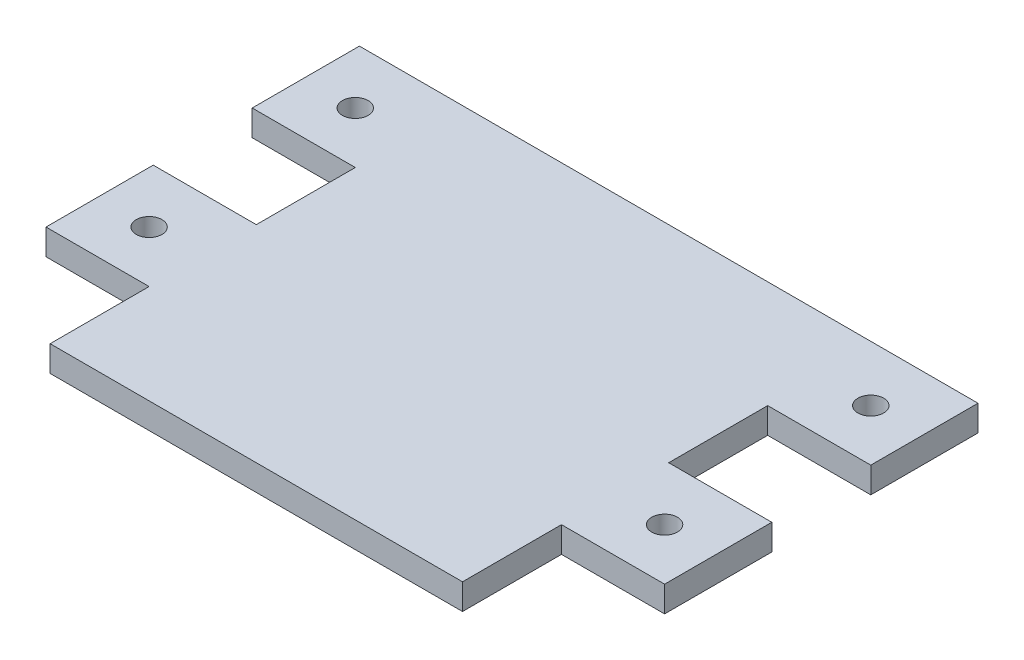
ISO-10303-21;
HEADER;
FILE_DESCRIPTION(('STEP AP214'),'2;1');
FILE_NAME('part.step','',(''),(''),'','','');
FILE_SCHEMA(('AUTOMOTIVE_DESIGN { 1 0 10303 214 1 1 1 1 }'));
ENDSEC;
DATA;
#1=APPLICATION_CONTEXT('core data for automotive mechanical design processes');
#2=APPLICATION_PROTOCOL_DEFINITION('international standard','automotive_design',2000,#1);
#3=PRODUCT_CONTEXT('',#1,'mechanical');
#4=PRODUCT('Part','Part','',(#3));
#5=PRODUCT_RELATED_PRODUCT_CATEGORY('part','',(#4));
#6=PRODUCT_DEFINITION_FORMATION('','',#4);
#7=PRODUCT_DEFINITION_CONTEXT('part definition',#1,'design');
#8=PRODUCT_DEFINITION('design','',#6,#7);
#9=PRODUCT_DEFINITION_SHAPE('','',#8);
#10=(LENGTH_UNIT() NAMED_UNIT(*) SI_UNIT(.MILLI.,.METRE.));
#11=(NAMED_UNIT(*) PLANE_ANGLE_UNIT() SI_UNIT($,.RADIAN.));
#12=(NAMED_UNIT(*) SI_UNIT($,.STERADIAN.) SOLID_ANGLE_UNIT());
#13=UNCERTAINTY_MEASURE_WITH_UNIT(LENGTH_MEASURE(1.E-05),#10,'distance_accuracy_value','');
#14=(GEOMETRIC_REPRESENTATION_CONTEXT(3) GLOBAL_UNCERTAINTY_ASSIGNED_CONTEXT((#13)) GLOBAL_UNIT_ASSIGNED_CONTEXT((#10,
#11,#12)) REPRESENTATION_CONTEXT('',''));
#15=CARTESIAN_POINT('',(0.,0.,0.));
#16=DIRECTION('',(0.,0.,1.));
#17=DIRECTION('',(1.,0.,0.));
#18=AXIS2_PLACEMENT_3D('',#15,#16,#17);
#19=CARTESIAN_POINT('',(0.,3.175,0.));
#20=DIRECTION('',(1.,0.,0.));
#21=DIRECTION('',(0.,0.,-1.));
#22=AXIS2_PLACEMENT_3D('',#19,#20,#21);
#23=PLANE('',#22);
#24=DIRECTION('',(0.,1.,0.));
#25=VECTOR('',#24,1.);
#26=CARTESIAN_POINT('',(0.,0.,-12.192));
#27=LINE('',#26,#25);
#28=CARTESIAN_POINT('',(0.,0.,-12.192));
#29=VERTEX_POINT('',#28);
#30=CARTESIAN_POINT('',(0.,3.175,-12.192));
#31=VERTEX_POINT('',#30);
#32=EDGE_CURVE('E182',#29,#31,#27,.T.);
#33=ORIENTED_EDGE('',*,*,#32,.F.);
#34=DIRECTION('',(0.,0.,1.));
#35=VECTOR('',#34,1.);
#36=CARTESIAN_POINT('',(0.,0.,0.));
#37=LINE('',#36,#35);
#38=CARTESIAN_POINT('',(0.,0.,0.));
#39=VERTEX_POINT('',#38);
#40=EDGE_CURVE('E267',#29,#39,#37,.T.);
#41=ORIENTED_EDGE('',*,*,#40,.T.);
#42=DIRECTION('',(0.,-1.,0.));
#43=VECTOR('',#42,1.);
#44=CARTESIAN_POINT('',(0.,3.175,0.));
#45=LINE('',#44,#43);
#46=CARTESIAN_POINT('',(0.,3.175,0.));
#47=VERTEX_POINT('',#46);
#48=EDGE_CURVE('E11',#47,#39,#45,.T.);
#49=ORIENTED_EDGE('',*,*,#48,.F.);
#50=DIRECTION('',(0.,0.,1.));
#51=VECTOR('',#50,1.);
#52=CARTESIAN_POINT('',(0.,3.175,0.));
#53=LINE('',#52,#51);
#54=EDGE_CURVE('E47',#31,#47,#53,.T.);
#55=ORIENTED_EDGE('',*,*,#54,.F.);
#56=EDGE_LOOP('',(#33,#41,#49,#55));
#57=FACE_BOUND('',#56,.T.);
#58=ADVANCED_FACE('F33',(#57),#23,.F.);
#59=DIRECTION('',(0.,1.,0.));
#60=VECTOR('',#59,1.);
#61=CARTESIAN_POINT('',(0.,0.,-25.4));
#62=LINE('',#61,#60);
#63=CARTESIAN_POINT('',(0.,0.,-25.4));
#64=VERTEX_POINT('',#63);
#65=CARTESIAN_POINT('',(0.,3.175,-25.4));
#66=VERTEX_POINT('',#65);
#67=EDGE_CURVE('E55',#64,#66,#62,.T.);
#68=ORIENTED_EDGE('',*,*,#67,.T.);
#69=CARTESIAN_POINT('',(0.,3.175,-37.592));
#70=VERTEX_POINT('',#69);
#71=EDGE_CURVE('E272',#70,#66,#53,.T.);
#72=ORIENTED_EDGE('',*,*,#71,.F.);
#73=DIRECTION('',(0.,1.,0.));
#74=VECTOR('',#73,1.);
#75=CARTESIAN_POINT('',(0.,0.,-37.592));
#76=LINE('',#75,#74);
#77=CARTESIAN_POINT('',(0.,0.,-37.592));
#78=VERTEX_POINT('',#77);
#79=EDGE_CURVE('E204',#78,#70,#76,.T.);
#80=ORIENTED_EDGE('',*,*,#79,.F.);
#81=EDGE_CURVE('E282',#78,#64,#37,.T.);
#82=ORIENTED_EDGE('',*,*,#81,.T.);
#83=EDGE_LOOP('',(#68,#72,#80,#82));
#84=FACE_BOUND('',#83,.T.);
#85=ADVANCED_FACE('F315',(#84),#23,.F.);
#86=CARTESIAN_POINT('',(50.8,3.175,0.));
#87=DIRECTION('',(-1.,0.,0.));
#88=DIRECTION('',(0.,0.,1.));
#89=AXIS2_PLACEMENT_3D('',#86,#87,#88);
#90=PLANE('',#89);
#91=DIRECTION('',(0.,0.,-1.));
#92=VECTOR('',#91,1.);
#93=CARTESIAN_POINT('',(50.8,3.175,0.));
#94=LINE('',#93,#92);
#95=CARTESIAN_POINT('',(50.8,3.175,-25.4));
#96=VERTEX_POINT('',#95);
#97=CARTESIAN_POINT('',(50.8,3.175,-37.592));
#98=VERTEX_POINT('',#97);
#99=EDGE_CURVE('E276',#96,#98,#94,.T.);
#100=ORIENTED_EDGE('',*,*,#99,.F.);
#101=DIRECTION('',(0.,1.,0.));
#102=VECTOR('',#101,1.);
#103=CARTESIAN_POINT('',(50.8,0.,-25.4));
#104=LINE('',#103,#102);
#105=CARTESIAN_POINT('',(50.8,0.,-25.4));
#106=VERTEX_POINT('',#105);
#107=EDGE_CURVE('E237',#106,#96,#104,.T.);
#108=ORIENTED_EDGE('',*,*,#107,.F.);
#109=DIRECTION('',(0.,0.,-1.));
#110=VECTOR('',#109,1.);
#111=CARTESIAN_POINT('',(50.8,0.,0.));
#112=LINE('',#111,#110);
#113=CARTESIAN_POINT('',(50.8,0.,-37.592));
#114=VERTEX_POINT('',#113);
#115=EDGE_CURVE('E286',#106,#114,#112,.T.);
#116=ORIENTED_EDGE('',*,*,#115,.T.);
#117=DIRECTION('',(0.,1.,0.));
#118=VECTOR('',#117,1.);
#119=CARTESIAN_POINT('',(50.8,0.,-37.592));
#120=LINE('',#119,#118);
#121=EDGE_CURVE('E259',#114,#98,#120,.T.);
#122=ORIENTED_EDGE('',*,*,#121,.T.);
#123=EDGE_LOOP('',(#100,#108,#116,#122));
#124=FACE_BOUND('',#123,.T.);
#125=ADVANCED_FACE('F338',(#124),#90,.F.);
#126=CARTESIAN_POINT('',(0.,3.175,0.));
#127=DIRECTION('',(0.,0.,-1.));
#128=DIRECTION('',(-1.,0.,0.));
#129=AXIS2_PLACEMENT_3D('',#126,#127,#128);
#130=PLANE('',#129);
#131=DIRECTION('',(1.,0.,0.));
#132=VECTOR('',#131,1.);
#133=CARTESIAN_POINT('',(0.,0.,0.));
#134=LINE('',#133,#132);
#135=CARTESIAN_POINT('',(50.8,0.,0.));
#136=VERTEX_POINT('',#135);
#137=EDGE_CURVE('E284',#39,#136,#134,.T.);
#138=ORIENTED_EDGE('',*,*,#137,.T.);
#139=DIRECTION('',(0.,-1.,0.));
#140=VECTOR('',#139,1.);
#141=CARTESIAN_POINT('',(50.8,3.175,0.));
#142=LINE('',#141,#140);
#143=CARTESIAN_POINT('',(50.8,3.175,0.));
#144=VERTEX_POINT('',#143);
#145=EDGE_CURVE('E40',#144,#136,#142,.T.);
#146=ORIENTED_EDGE('',*,*,#145,.F.);
#147=DIRECTION('',(1.,0.,0.));
#148=VECTOR('',#147,1.);
#149=CARTESIAN_POINT('',(0.,3.175,0.));
#150=LINE('',#149,#148);
#151=EDGE_CURVE('E274',#47,#144,#150,.T.);
#152=ORIENTED_EDGE('',*,*,#151,.F.);
#153=ORIENTED_EDGE('',*,*,#48,.T.);
#154=EDGE_LOOP('',(#138,#146,#152,#153));
#155=FACE_BOUND('',#154,.T.);
#156=ADVANCED_FACE('F310',(#155),#130,.F.);
#157=CARTESIAN_POINT('',(50.8,0.,-12.192));
#158=VERTEX_POINT('',#157);
#159=EDGE_CURVE('E287',#136,#158,#112,.T.);
#160=ORIENTED_EDGE('',*,*,#159,.T.);
#161=DIRECTION('',(0.,1.,0.));
#162=VECTOR('',#161,1.);
#163=CARTESIAN_POINT('',(50.8,0.,-12.192));
#164=LINE('',#163,#162);
#165=CARTESIAN_POINT('',(50.8,3.175,-12.192));
#166=VERTEX_POINT('',#165);
#167=EDGE_CURVE('E229',#158,#166,#164,.T.);
#168=ORIENTED_EDGE('',*,*,#167,.T.);
#169=EDGE_CURVE('E277',#144,#166,#94,.T.);
#170=ORIENTED_EDGE('',*,*,#169,.F.);
#171=ORIENTED_EDGE('',*,*,#145,.T.);
#172=EDGE_LOOP('',(#160,#168,#170,#171));
#173=FACE_BOUND('',#172,.T.);
#174=ADVANCED_FACE('F295',(#173),#90,.F.);
#175=CARTESIAN_POINT('',(0.,3.175,-50.8));
#176=DIRECTION('',(0.,0.,1.));
#177=DIRECTION('',(1.,0.,0.));
#178=AXIS2_PLACEMENT_3D('',#175,#176,#177);
#179=PLANE('',#178);
#180=DIRECTION('',(-1.,0.,0.));
#181=VECTOR('',#180,1.);
#182=CARTESIAN_POINT('',(0.,0.,-50.8));
#183=LINE('',#182,#181);
#184=CARTESIAN_POINT('',(63.5,0.,-50.8));
#185=VERTEX_POINT('',#184);
#186=CARTESIAN_POINT('',(-12.7,0.,-50.8));
#187=VERTEX_POINT('',#186);
#188=EDGE_CURVE('E289',#185,#187,#183,.T.);
#189=ORIENTED_EDGE('',*,*,#188,.T.);
#190=DIRECTION('',(0.,1.,0.));
#191=VECTOR('',#190,1.);
#192=CARTESIAN_POINT('',(-12.7,0.,-50.8));
#193=LINE('',#192,#191);
#194=CARTESIAN_POINT('',(-12.7,3.175,-50.8));
#195=VERTEX_POINT('',#194);
#196=EDGE_CURVE('E200',#187,#195,#193,.T.);
#197=ORIENTED_EDGE('',*,*,#196,.T.);
#198=DIRECTION('',(-1.,0.,0.));
#199=VECTOR('',#198,1.);
#200=CARTESIAN_POINT('',(0.,3.175,-50.8));
#201=LINE('',#200,#199);
#202=CARTESIAN_POINT('',(63.5,3.175,-50.8));
#203=VERTEX_POINT('',#202);
#204=EDGE_CURVE('E280',#203,#195,#201,.T.);
#205=ORIENTED_EDGE('',*,*,#204,.F.);
#206=DIRECTION('',(0.,1.,0.));
#207=VECTOR('',#206,1.);
#208=CARTESIAN_POINT('',(63.5,0.,-50.8));
#209=LINE('',#208,#207);
#210=EDGE_CURVE('E264',#185,#203,#209,.T.);
#211=ORIENTED_EDGE('',*,*,#210,.F.);
#212=EDGE_LOOP('',(#189,#197,#205,#211));
#213=FACE_BOUND('',#212,.T.);
#214=ADVANCED_FACE('F328',(#213),#179,.F.);
#215=CARTESIAN_POINT('',(0.,3.175,0.));
#216=DIRECTION('',(0.,-1.,0.));
#217=DIRECTION('',(0.,0.,-1.));
#218=AXIS2_PLACEMENT_3D('',#215,#216,#217);
#219=PLANE('',#218);
#220=ORIENTED_EDGE('',*,*,#204,.T.);
#221=DIRECTION('',(0.,0.,-1.));
#222=VECTOR('',#221,1.);
#223=CARTESIAN_POINT('',(-12.7,3.175,-50.8));
#224=LINE('',#223,#222);
#225=CARTESIAN_POINT('',(-12.7,3.175,-37.592));
#226=VERTEX_POINT('',#225);
#227=EDGE_CURVE('E191',#226,#195,#224,.T.);
#228=ORIENTED_EDGE('',*,*,#227,.F.);
#229=DIRECTION('',(-1.,0.,0.));
#230=VECTOR('',#229,1.);
#231=CARTESIAN_POINT('',(0.,3.175,-37.592));
#232=LINE('',#231,#230);
#233=EDGE_CURVE('E198',#70,#226,#232,.T.);
#234=ORIENTED_EDGE('',*,*,#233,.F.);
#235=ORIENTED_EDGE('',*,*,#71,.T.);
#236=DIRECTION('',(1.,0.,0.));
#237=VECTOR('',#236,1.);
#238=CARTESIAN_POINT('',(0.,3.175,-25.4));
#239=LINE('',#238,#237);
#240=CARTESIAN_POINT('',(-12.7,3.175,-25.4));
#241=VERTEX_POINT('',#240);
#242=EDGE_CURVE('E178',#241,#66,#239,.T.);
#243=ORIENTED_EDGE('',*,*,#242,.F.);
#244=DIRECTION('',(0.,0.,-1.));
#245=VECTOR('',#244,1.);
#246=CARTESIAN_POINT('',(-12.7,3.175,-25.4));
#247=LINE('',#246,#245);
#248=CARTESIAN_POINT('',(-12.7,3.175,-12.192));
#249=VERTEX_POINT('',#248);
#250=EDGE_CURVE('E163',#249,#241,#247,.T.);
#251=ORIENTED_EDGE('',*,*,#250,.F.);
#252=DIRECTION('',(-1.,0.,0.));
#253=VECTOR('',#252,1.);
#254=CARTESIAN_POINT('',(0.,3.175,-12.192));
#255=LINE('',#254,#253);
#256=EDGE_CURVE('E170',#31,#249,#255,.T.);
#257=ORIENTED_EDGE('',*,*,#256,.F.);
#258=ORIENTED_EDGE('',*,*,#54,.T.);
#259=ORIENTED_EDGE('',*,*,#151,.T.);
#260=ORIENTED_EDGE('',*,*,#169,.T.);
#261=DIRECTION('',(1.,0.,0.));
#262=VECTOR('',#261,1.);
#263=CARTESIAN_POINT('',(50.8,3.175,-12.192));
#264=LINE('',#263,#262);
#265=CARTESIAN_POINT('',(63.5,3.175,-12.192));
#266=VERTEX_POINT('',#265);
#267=EDGE_CURVE('E216',#166,#266,#264,.T.);
#268=ORIENTED_EDGE('',*,*,#267,.T.);
#269=DIRECTION('',(0.,0.,-1.));
#270=VECTOR('',#269,1.);
#271=CARTESIAN_POINT('',(63.5,3.175,-25.4));
#272=LINE('',#271,#270);
#273=CARTESIAN_POINT('',(63.5,3.175,-25.4));
#274=VERTEX_POINT('',#273);
#275=EDGE_CURVE('E232',#266,#274,#272,.T.);
#276=ORIENTED_EDGE('',*,*,#275,.T.);
#277=DIRECTION('',(-1.,0.,0.));
#278=VECTOR('',#277,1.);
#279=CARTESIAN_POINT('',(50.8,3.175,-25.4));
#280=LINE('',#279,#278);
#281=EDGE_CURVE('E223',#274,#96,#280,.T.);
#282=ORIENTED_EDGE('',*,*,#281,.T.);
#283=ORIENTED_EDGE('',*,*,#99,.T.);
#284=DIRECTION('',(1.,0.,0.));
#285=VECTOR('',#284,1.);
#286=CARTESIAN_POINT('',(50.8,3.175,-37.592));
#287=LINE('',#286,#285);
#288=CARTESIAN_POINT('',(63.5,3.175,-37.592));
#289=VERTEX_POINT('',#288);
#290=EDGE_CURVE('E249',#98,#289,#287,.T.);
#291=ORIENTED_EDGE('',*,*,#290,.T.);
#292=DIRECTION('',(0.,0.,-1.));
#293=VECTOR('',#292,1.);
#294=CARTESIAN_POINT('',(63.5,3.175,-50.8));
#295=LINE('',#294,#293);
#296=EDGE_CURVE('E256',#289,#203,#295,.T.);
#297=ORIENTED_EDGE('',*,*,#296,.T.);
#298=EDGE_LOOP('',(#220,#228,#234,#235,#243,#251,#257,#258,#259,#260,#268,#276,#282,#283,#291,#297));
#299=FACE_BOUND('',#298,.T.);
#300=CARTESIAN_POINT('',(57.15,3.175,-43.942));
#301=DIRECTION('',(0.,1.,0.));
#302=DIRECTION('',(0.,0.,1.));
#303=AXIS2_PLACEMENT_3D('',#300,#301,#302);
#304=CIRCLE('',#303,1.5875);
#305=CARTESIAN_POINT('',(57.15,3.175,-42.3545));
#306=VERTEX_POINT('',#305);
#307=EDGE_CURVE('E240',#306,#306,#304,.T.);
#308=ORIENTED_EDGE('',*,*,#307,.F.);
#309=EDGE_LOOP('',(#308));
#310=FACE_BOUND('',#309,.T.);
#311=CARTESIAN_POINT('',(57.15,3.175,-18.542));
#312=DIRECTION('',(0.,1.,0.));
#313=DIRECTION('',(0.,0.,1.));
#314=AXIS2_PLACEMENT_3D('',#311,#312,#313);
#315=CIRCLE('',#314,1.5875);
#316=CARTESIAN_POINT('',(57.15,3.175,-16.9545));
#317=VERTEX_POINT('',#316);
#318=EDGE_CURVE('E207',#317,#317,#315,.T.);
#319=ORIENTED_EDGE('',*,*,#318,.F.);
#320=EDGE_LOOP('',(#319));
#321=FACE_BOUND('',#320,.T.);
#322=CARTESIAN_POINT('',(-6.35000000000001,3.175,-43.942));
#323=DIRECTION('',(0.,-1.,0.));
#324=DIRECTION('',(0.,0.,1.));
#325=AXIS2_PLACEMENT_3D('',#322,#323,#324);
#326=CIRCLE('',#325,1.5875);
#327=CARTESIAN_POINT('',(-6.35000000000001,3.175,-42.3545));
#328=VERTEX_POINT('',#327);
#329=EDGE_CURVE('E185',#328,#328,#326,.T.);
#330=ORIENTED_EDGE('',*,*,#329,.T.);
#331=EDGE_LOOP('',(#330));
#332=FACE_BOUND('',#331,.T.);
#333=CARTESIAN_POINT('',(-6.34999999999999,3.175,-18.542));
#334=DIRECTION('',(0.,-1.,0.));
#335=DIRECTION('',(0.,0.,1.));
#336=AXIS2_PLACEMENT_3D('',#333,#334,#335);
#337=CIRCLE('',#336,1.5875);
#338=CARTESIAN_POINT('',(-6.34999999999999,3.175,-16.9545));
#339=VERTEX_POINT('',#338);
#340=EDGE_CURVE('E174',#339,#339,#337,.T.);
#341=ORIENTED_EDGE('',*,*,#340,.T.);
#342=EDGE_LOOP('',(#341));
#343=FACE_BOUND('',#342,.T.);
#344=ADVANCED_FACE('F308',(#299,#310,#321,#332,#343),#219,.F.);
#345=CARTESIAN_POINT('',(0.,0.,0.));
#346=DIRECTION('',(0.,-1.,0.));
#347=DIRECTION('',(0.,0.,-1.));
#348=AXIS2_PLACEMENT_3D('',#345,#346,#347);
#349=PLANE('',#348);
#350=ORIENTED_EDGE('',*,*,#81,.F.);
#351=DIRECTION('',(-1.,0.,0.));
#352=VECTOR('',#351,1.);
#353=CARTESIAN_POINT('',(0.,0.,-37.592));
#354=LINE('',#353,#352);
#355=CARTESIAN_POINT('',(-12.7,0.,-37.592));
#356=VERTEX_POINT('',#355);
#357=EDGE_CURVE('E197',#78,#356,#354,.T.);
#358=ORIENTED_EDGE('',*,*,#357,.T.);
#359=DIRECTION('',(0.,0.,-1.));
#360=VECTOR('',#359,1.);
#361=CARTESIAN_POINT('',(-12.7,0.,-50.8));
#362=LINE('',#361,#360);
#363=EDGE_CURVE('E194',#356,#187,#362,.T.);
#364=ORIENTED_EDGE('',*,*,#363,.T.);
#365=ORIENTED_EDGE('',*,*,#188,.F.);
#366=DIRECTION('',(0.,0.,-1.));
#367=VECTOR('',#366,1.);
#368=CARTESIAN_POINT('',(63.5,0.,-50.8));
#369=LINE('',#368,#367);
#370=CARTESIAN_POINT('',(63.5,0.,-37.592));
#371=VERTEX_POINT('',#370);
#372=EDGE_CURVE('E255',#371,#185,#369,.T.);
#373=ORIENTED_EDGE('',*,*,#372,.F.);
#374=DIRECTION('',(1.,0.,0.));
#375=VECTOR('',#374,1.);
#376=CARTESIAN_POINT('',(50.8,0.,-37.592));
#377=LINE('',#376,#375);
#378=EDGE_CURVE('E252',#114,#371,#377,.T.);
#379=ORIENTED_EDGE('',*,*,#378,.F.);
#380=ORIENTED_EDGE('',*,*,#115,.F.);
#381=DIRECTION('',(-1.,0.,0.));
#382=VECTOR('',#381,1.);
#383=CARTESIAN_POINT('',(50.8,0.,-25.4));
#384=LINE('',#383,#382);
#385=CARTESIAN_POINT('',(63.5,0.,-25.4));
#386=VERTEX_POINT('',#385);
#387=EDGE_CURVE('E226',#386,#106,#384,.T.);
#388=ORIENTED_EDGE('',*,*,#387,.F.);
#389=DIRECTION('',(0.,0.,-1.));
#390=VECTOR('',#389,1.);
#391=CARTESIAN_POINT('',(63.5,0.,-25.4));
#392=LINE('',#391,#390);
#393=CARTESIAN_POINT('',(63.5,0.,-12.192));
#394=VERTEX_POINT('',#393);
#395=EDGE_CURVE('E222',#394,#386,#392,.T.);
#396=ORIENTED_EDGE('',*,*,#395,.F.);
#397=DIRECTION('',(1.,0.,0.));
#398=VECTOR('',#397,1.);
#399=CARTESIAN_POINT('',(50.8,0.,-12.192));
#400=LINE('',#399,#398);
#401=EDGE_CURVE('E219',#158,#394,#400,.T.);
#402=ORIENTED_EDGE('',*,*,#401,.F.);
#403=ORIENTED_EDGE('',*,*,#159,.F.);
#404=ORIENTED_EDGE('',*,*,#137,.F.);
#405=ORIENTED_EDGE('',*,*,#40,.F.);
#406=DIRECTION('',(-1.,0.,0.));
#407=VECTOR('',#406,1.);
#408=CARTESIAN_POINT('',(0.,0.,-12.192));
#409=LINE('',#408,#407);
#410=CARTESIAN_POINT('',(-12.7,0.,-12.192));
#411=VERTEX_POINT('',#410);
#412=EDGE_CURVE('E154',#29,#411,#409,.T.);
#413=ORIENTED_EDGE('',*,*,#412,.T.);
#414=DIRECTION('',(0.,0.,-1.));
#415=VECTOR('',#414,1.);
#416=CARTESIAN_POINT('',(-12.7,0.,-25.4));
#417=LINE('',#416,#415);
#418=CARTESIAN_POINT('',(-12.7,0.,-25.4));
#419=VERTEX_POINT('',#418);
#420=EDGE_CURVE('E146',#411,#419,#417,.T.);
#421=ORIENTED_EDGE('',*,*,#420,.T.);
#422=DIRECTION('',(1.,0.,0.));
#423=VECTOR('',#422,1.);
#424=CARTESIAN_POINT('',(0.,0.,-25.4));
#425=LINE('',#424,#423);
#426=EDGE_CURVE('E152',#419,#64,#425,.T.);
#427=ORIENTED_EDGE('',*,*,#426,.T.);
#428=EDGE_LOOP('',(#350,#358,#364,#365,#373,#379,#380,#388,#396,#402,#403,#404,#405,#413,#421,#427));
#429=FACE_BOUND('',#428,.T.);
#430=CARTESIAN_POINT('',(57.15,0.,-43.942));
#431=DIRECTION('',(0.,1.,0.));
#432=DIRECTION('',(0.,0.,1.));
#433=AXIS2_PLACEMENT_3D('',#430,#431,#432);
#434=CIRCLE('',#433,1.5875);
#435=CARTESIAN_POINT('',(57.15,0.,-42.3545));
#436=VERTEX_POINT('',#435);
#437=EDGE_CURVE('E246',#436,#436,#434,.T.);
#438=ORIENTED_EDGE('',*,*,#437,.T.);
#439=EDGE_LOOP('',(#438));
#440=FACE_BOUND('',#439,.T.);
#441=CARTESIAN_POINT('',(57.15,0.,-18.542));
#442=DIRECTION('',(0.,1.,0.));
#443=DIRECTION('',(0.,0.,1.));
#444=AXIS2_PLACEMENT_3D('',#441,#442,#443);
#445=CIRCLE('',#444,1.5875);
#446=CARTESIAN_POINT('',(57.15,0.,-16.9545));
#447=VERTEX_POINT('',#446);
#448=EDGE_CURVE('E213',#447,#447,#445,.T.);
#449=ORIENTED_EDGE('',*,*,#448,.T.);
#450=EDGE_LOOP('',(#449));
#451=FACE_BOUND('',#450,.T.);
#452=CARTESIAN_POINT('',(-6.35000000000001,0.,-43.942));
#453=DIRECTION('',(0.,-1.,0.));
#454=DIRECTION('',(0.,0.,1.));
#455=AXIS2_PLACEMENT_3D('',#452,#453,#454);
#456=CIRCLE('',#455,1.5875);
#457=CARTESIAN_POINT('',(-6.35000000000001,0.,-42.3545));
#458=VERTEX_POINT('',#457);
#459=EDGE_CURVE('E188',#458,#458,#456,.T.);
#460=ORIENTED_EDGE('',*,*,#459,.F.);
#461=EDGE_LOOP('',(#460));
#462=FACE_BOUND('',#461,.T.);
#463=CARTESIAN_POINT('',(-6.34999999999999,0.,-18.542));
#464=DIRECTION('',(0.,-1.,0.));
#465=DIRECTION('',(0.,0.,1.));
#466=AXIS2_PLACEMENT_3D('',#463,#464,#465);
#467=CIRCLE('',#466,1.5875);
#468=CARTESIAN_POINT('',(-6.34999999999999,0.,-16.9545));
#469=VERTEX_POINT('',#468);
#470=EDGE_CURVE('E180',#469,#469,#467,.T.);
#471=ORIENTED_EDGE('',*,*,#470,.F.);
#472=EDGE_LOOP('',(#471));
#473=FACE_BOUND('',#472,.T.);
#474=ADVANCED_FACE('F149',(#429,#440,#451,#462,#473),#349,.T.);
#475=CARTESIAN_POINT('',(63.5,0.,-50.8));
#476=DIRECTION('',(1.,0.,0.));
#477=DIRECTION('',(0.,0.,-1.));
#478=AXIS2_PLACEMENT_3D('',#475,#476,#477);
#479=PLANE('',#478);
#480=ORIENTED_EDGE('',*,*,#296,.F.);
#481=DIRECTION('',(0.,1.,0.));
#482=VECTOR('',#481,1.);
#483=CARTESIAN_POINT('',(63.5,0.,-37.592));
#484=LINE('',#483,#482);
#485=EDGE_CURVE('E268',#371,#289,#484,.T.);
#486=ORIENTED_EDGE('',*,*,#485,.F.);
#487=ORIENTED_EDGE('',*,*,#372,.T.);
#488=ORIENTED_EDGE('',*,*,#210,.T.);
#489=EDGE_LOOP('',(#480,#486,#487,#488));
#490=FACE_BOUND('',#489,.T.);
#491=ADVANCED_FACE('F331',(#490),#479,.T.);
#492=CARTESIAN_POINT('',(50.8,0.,-37.592));
#493=DIRECTION('',(0.,0.,1.));
#494=DIRECTION('',(1.,0.,0.));
#495=AXIS2_PLACEMENT_3D('',#492,#493,#494);
#496=PLANE('',#495);
#497=ORIENTED_EDGE('',*,*,#290,.F.);
#498=ORIENTED_EDGE('',*,*,#121,.F.);
#499=ORIENTED_EDGE('',*,*,#378,.T.);
#500=ORIENTED_EDGE('',*,*,#485,.T.);
#501=EDGE_LOOP('',(#497,#498,#499,#500));
#502=FACE_BOUND('',#501,.T.);
#503=ADVANCED_FACE('F334',(#502),#496,.T.);
#504=CARTESIAN_POINT('',(57.15,0.,-43.942));
#505=DIRECTION('',(0.,1.,0.));
#506=DIRECTION('',(0.,0.,1.));
#507=AXIS2_PLACEMENT_3D('',#504,#505,#506);
#508=CYLINDRICAL_SURFACE('',#507,1.5875);
#509=ORIENTED_EDGE('',*,*,#437,.F.);
#510=EDGE_LOOP('',(#509));
#511=FACE_BOUND('',#510,.T.);
#512=ORIENTED_EDGE('',*,*,#307,.T.);
#513=EDGE_LOOP('',(#512));
#514=FACE_BOUND('',#513,.T.);
#515=ADVANCED_FACE('F352',(#511,#514),#508,.F.);
#516=CARTESIAN_POINT('',(50.8,0.,-25.4));
#517=DIRECTION('',(0.,0.,-1.));
#518=DIRECTION('',(-1.,0.,0.));
#519=AXIS2_PLACEMENT_3D('',#516,#517,#518);
#520=PLANE('',#519);
#521=ORIENTED_EDGE('',*,*,#281,.F.);
#522=DIRECTION('',(0.,1.,0.));
#523=VECTOR('',#522,1.);
#524=CARTESIAN_POINT('',(63.5,0.,-25.4));
#525=LINE('',#524,#523);
#526=EDGE_CURVE('E241',#386,#274,#525,.T.);
#527=ORIENTED_EDGE('',*,*,#526,.F.);
#528=ORIENTED_EDGE('',*,*,#387,.T.);
#529=ORIENTED_EDGE('',*,*,#107,.T.);
#530=EDGE_LOOP('',(#521,#527,#528,#529));
#531=FACE_BOUND('',#530,.T.);
#532=ADVANCED_FACE('F341',(#531),#520,.T.);
#533=CARTESIAN_POINT('',(63.5,0.,-25.4));
#534=DIRECTION('',(1.,0.,0.));
#535=DIRECTION('',(0.,0.,-1.));
#536=AXIS2_PLACEMENT_3D('',#533,#534,#535);
#537=PLANE('',#536);
#538=ORIENTED_EDGE('',*,*,#275,.F.);
#539=DIRECTION('',(0.,1.,0.));
#540=VECTOR('',#539,1.);
#541=CARTESIAN_POINT('',(63.5,0.,-12.192));
#542=LINE('',#541,#540);
#543=EDGE_CURVE('E243',#394,#266,#542,.T.);
#544=ORIENTED_EDGE('',*,*,#543,.F.);
#545=ORIENTED_EDGE('',*,*,#395,.T.);
#546=ORIENTED_EDGE('',*,*,#526,.T.);
#547=EDGE_LOOP('',(#538,#544,#545,#546));
#548=FACE_BOUND('',#547,.T.);
#549=ADVANCED_FACE('F343',(#548),#537,.T.);
#550=CARTESIAN_POINT('',(50.8,0.,-12.192));
#551=DIRECTION('',(0.,0.,1.));
#552=DIRECTION('',(1.,0.,0.));
#553=AXIS2_PLACEMENT_3D('',#550,#551,#552);
#554=PLANE('',#553);
#555=ORIENTED_EDGE('',*,*,#267,.F.);
#556=ORIENTED_EDGE('',*,*,#167,.F.);
#557=ORIENTED_EDGE('',*,*,#401,.T.);
#558=ORIENTED_EDGE('',*,*,#543,.T.);
#559=EDGE_LOOP('',(#555,#556,#557,#558));
#560=FACE_BOUND('',#559,.T.);
#561=ADVANCED_FACE('F305',(#560),#554,.T.);
#562=CARTESIAN_POINT('',(57.15,0.,-18.542));
#563=DIRECTION('',(0.,1.,0.));
#564=DIRECTION('',(0.,0.,1.));
#565=AXIS2_PLACEMENT_3D('',#562,#563,#564);
#566=CYLINDRICAL_SURFACE('',#565,1.5875);
#567=ORIENTED_EDGE('',*,*,#448,.F.);
#568=EDGE_LOOP('',(#567));
#569=FACE_BOUND('',#568,.T.);
#570=ORIENTED_EDGE('',*,*,#318,.T.);
#571=EDGE_LOOP('',(#570));
#572=FACE_BOUND('',#571,.T.);
#573=ADVANCED_FACE('F350',(#569,#572),#566,.F.);
#574=CARTESIAN_POINT('',(0.,0.,-37.592));
#575=DIRECTION('',(0.,0.,-1.));
#576=DIRECTION('',(-1.,0.,0.));
#577=AXIS2_PLACEMENT_3D('',#574,#575,#576);
#578=PLANE('',#577);
#579=ORIENTED_EDGE('',*,*,#233,.T.);
#580=DIRECTION('',(0.,1.,0.));
#581=VECTOR('',#580,1.);
#582=CARTESIAN_POINT('',(-12.7,0.,-37.592));
#583=LINE('',#582,#581);
#584=EDGE_CURVE('E208',#356,#226,#583,.T.);
#585=ORIENTED_EDGE('',*,*,#584,.F.);
#586=ORIENTED_EDGE('',*,*,#357,.F.);
#587=ORIENTED_EDGE('',*,*,#79,.T.);
#588=EDGE_LOOP('',(#579,#585,#586,#587));
#589=FACE_BOUND('',#588,.T.);
#590=ADVANCED_FACE('F319',(#589),#578,.F.);
#591=CARTESIAN_POINT('',(-12.7,0.,-50.8));
#592=DIRECTION('',(1.,0.,0.));
#593=DIRECTION('',(0.,0.,-1.));
#594=AXIS2_PLACEMENT_3D('',#591,#592,#593);
#595=PLANE('',#594);
#596=ORIENTED_EDGE('',*,*,#227,.T.);
#597=ORIENTED_EDGE('',*,*,#196,.F.);
#598=ORIENTED_EDGE('',*,*,#363,.F.);
#599=ORIENTED_EDGE('',*,*,#584,.T.);
#600=EDGE_LOOP('',(#596,#597,#598,#599));
#601=FACE_BOUND('',#600,.T.);
#602=ADVANCED_FACE('F323',(#601),#595,.F.);
#603=CARTESIAN_POINT('',(-6.35000000000001,0.,-43.942));
#604=DIRECTION('',(0.,1.,0.));
#605=DIRECTION('',(0.,0.,1.));
#606=AXIS2_PLACEMENT_3D('',#603,#604,#605);
#607=CYLINDRICAL_SURFACE('',#606,1.5875);
#608=ORIENTED_EDGE('',*,*,#459,.T.);
#609=EDGE_LOOP('',(#608));
#610=FACE_BOUND('',#609,.T.);
#611=ORIENTED_EDGE('',*,*,#329,.F.);
#612=EDGE_LOOP('',(#611));
#613=FACE_BOUND('',#612,.T.);
#614=ADVANCED_FACE('F410',(#610,#613),#607,.F.);
#615=CARTESIAN_POINT('',(0.,0.,-12.192));
#616=DIRECTION('',(0.,0.,-1.));
#617=DIRECTION('',(-1.,0.,0.));
#618=AXIS2_PLACEMENT_3D('',#615,#616,#617);
#619=PLANE('',#618);
#620=ORIENTED_EDGE('',*,*,#256,.T.);
#621=DIRECTION('',(0.,1.,0.));
#622=VECTOR('',#621,1.);
#623=CARTESIAN_POINT('',(-12.7,0.,-12.192));
#624=LINE('',#623,#622);
#625=EDGE_CURVE('E167',#411,#249,#624,.T.);
#626=ORIENTED_EDGE('',*,*,#625,.F.);
#627=ORIENTED_EDGE('',*,*,#412,.F.);
#628=ORIENTED_EDGE('',*,*,#32,.T.);
#629=EDGE_LOOP('',(#620,#626,#627,#628));
#630=FACE_BOUND('',#629,.T.);
#631=ADVANCED_FACE('F312',(#630),#619,.F.);
#632=CARTESIAN_POINT('',(-12.7,0.,-25.4));
#633=DIRECTION('',(1.,0.,0.));
#634=DIRECTION('',(0.,0.,-1.));
#635=AXIS2_PLACEMENT_3D('',#632,#633,#634);
#636=PLANE('',#635);
#637=ORIENTED_EDGE('',*,*,#250,.T.);
#638=DIRECTION('',(0.,1.,0.));
#639=VECTOR('',#638,1.);
#640=CARTESIAN_POINT('',(-12.7,0.,-25.4));
#641=LINE('',#640,#639);
#642=EDGE_CURVE('E160',#419,#241,#641,.T.);
#643=ORIENTED_EDGE('',*,*,#642,.F.);
#644=ORIENTED_EDGE('',*,*,#420,.F.);
#645=ORIENTED_EDGE('',*,*,#625,.T.);
#646=EDGE_LOOP('',(#637,#643,#644,#645));
#647=FACE_BOUND('',#646,.T.);
#648=ADVANCED_FACE('F161',(#647),#636,.F.);
#649=CARTESIAN_POINT('',(0.,0.,-25.4));
#650=DIRECTION('',(0.,0.,1.));
#651=DIRECTION('',(1.,0.,0.));
#652=AXIS2_PLACEMENT_3D('',#649,#650,#651);
#653=PLANE('',#652);
#654=ORIENTED_EDGE('',*,*,#242,.T.);
#655=ORIENTED_EDGE('',*,*,#67,.F.);
#656=ORIENTED_EDGE('',*,*,#426,.F.);
#657=ORIENTED_EDGE('',*,*,#642,.T.);
#658=EDGE_LOOP('',(#654,#655,#656,#657));
#659=FACE_BOUND('',#658,.T.);
#660=ADVANCED_FACE('F169',(#659),#653,.F.);
#661=CARTESIAN_POINT('',(-6.34999999999999,0.,-18.542));
#662=DIRECTION('',(0.,1.,0.));
#663=DIRECTION('',(0.,0.,1.));
#664=AXIS2_PLACEMENT_3D('',#661,#662,#663);
#665=CYLINDRICAL_SURFACE('',#664,1.5875);
#666=ORIENTED_EDGE('',*,*,#470,.T.);
#667=EDGE_LOOP('',(#666));
#668=FACE_BOUND('',#667,.T.);
#669=ORIENTED_EDGE('',*,*,#340,.F.);
#670=EDGE_LOOP('',(#669));
#671=FACE_BOUND('',#670,.T.);
#672=ADVANCED_FACE('F399',(#668,#671),#665,.F.);
#673=CLOSED_SHELL('',(#58,#85,#125,#156,#174,#214,#344,#474,#491,#503,#515,#532,#549,#561,#573,
#590,#602,#614,#631,#648,#660,#672));
#674=MANIFOLD_SOLID_BREP('B2',#673);
#675=ADVANCED_BREP_SHAPE_REPRESENTATION('',(#18,#674),#14);
#676=SHAPE_DEFINITION_REPRESENTATION(#9,#675);
ENDSEC;
END-ISO-10303-21;
